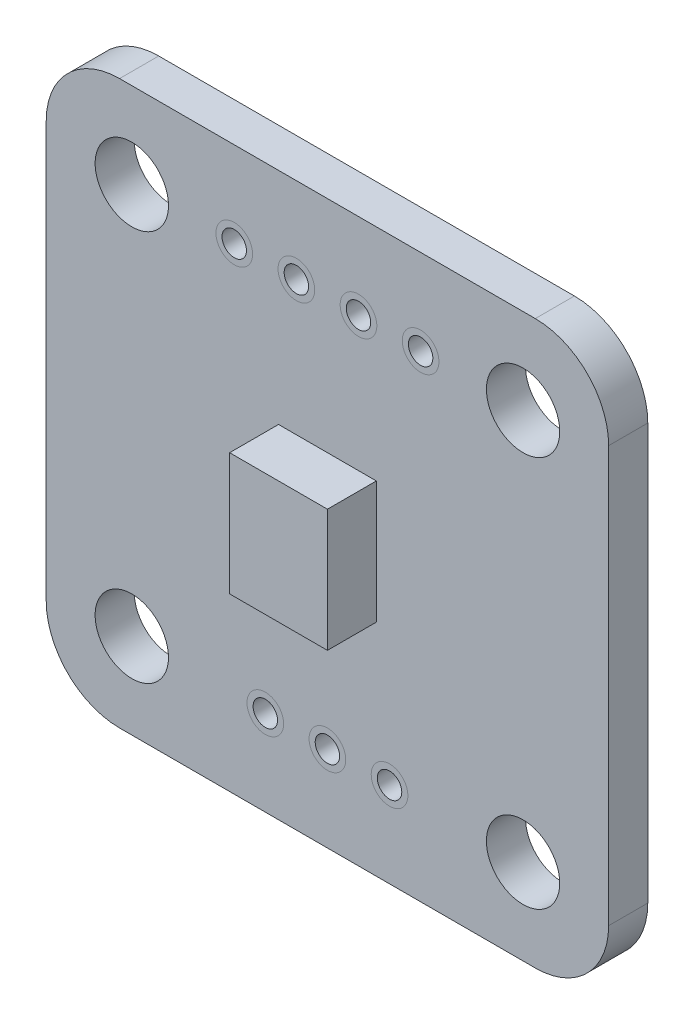
ISO-10303-21;
HEADER;
FILE_DESCRIPTION(('STEP AP214'),'2;1');
FILE_NAME('part.step','',(''),(''),'','','');
FILE_SCHEMA(('AUTOMOTIVE_DESIGN { 1 0 10303 214 1 1 1 1 }'));
ENDSEC;
DATA;
#1=APPLICATION_CONTEXT('core data for automotive mechanical design processes');
#2=APPLICATION_PROTOCOL_DEFINITION('international standard','automotive_design',2000,#1);
#3=PRODUCT_CONTEXT('',#1,'mechanical');
#4=PRODUCT('Part','Part','',(#3));
#5=PRODUCT_RELATED_PRODUCT_CATEGORY('part','',(#4));
#6=PRODUCT_DEFINITION_FORMATION('','',#4);
#7=PRODUCT_DEFINITION_CONTEXT('part definition',#1,'design');
#8=PRODUCT_DEFINITION('design','',#6,#7);
#9=PRODUCT_DEFINITION_SHAPE('','',#8);
#10=(LENGTH_UNIT() NAMED_UNIT(*) SI_UNIT(.MILLI.,.METRE.));
#11=(NAMED_UNIT(*) PLANE_ANGLE_UNIT() SI_UNIT($,.RADIAN.));
#12=(NAMED_UNIT(*) SI_UNIT($,.STERADIAN.) SOLID_ANGLE_UNIT());
#13=UNCERTAINTY_MEASURE_WITH_UNIT(LENGTH_MEASURE(1.E-05),#10,'distance_accuracy_value','');
#14=(GEOMETRIC_REPRESENTATION_CONTEXT(3) GLOBAL_UNCERTAINTY_ASSIGNED_CONTEXT((#13)) GLOBAL_UNIT_ASSIGNED_CONTEXT((#10,
#11,#12)) REPRESENTATION_CONTEXT('',''));
#15=CARTESIAN_POINT('',(0.,0.,0.));
#16=DIRECTION('',(0.,0.,1.));
#17=DIRECTION('',(1.,0.,0.));
#18=AXIS2_PLACEMENT_3D('',#15,#16,#17);
#19=CARTESIAN_POINT('',(-8.50000000000001,-8.5,-0.8));
#20=DIRECTION('',(0.,0.,-1.));
#21=DIRECTION('',(-1.,0.,0.));
#22=AXIS2_PLACEMENT_3D('',#19,#20,#21);
#23=PLANE('',#22);
#24=CARTESIAN_POINT('',(0.,-7.99999999999999,-0.8));
#25=DIRECTION('',(0.,0.,-1.));
#26=DIRECTION('',(-1.,0.,0.));
#27=AXIS2_PLACEMENT_3D('',#24,#25,#26);
#28=CIRCLE('',#27,0.75);
#29=CARTESIAN_POINT('',(-0.75,-7.99999999999999,-0.8));
#30=VERTEX_POINT('',#29);
#31=EDGE_CURVE('E323',#30,#30,#28,.F.);
#32=ORIENTED_EDGE('',*,*,#31,.T.);
#33=EDGE_LOOP('',(#32));
#34=FACE_BOUND('',#33,.T.);
#35=CARTESIAN_POINT('',(3.81,7.99999999999999,-0.8));
#36=DIRECTION('',(0.,0.,-1.));
#37=DIRECTION('',(-1.,0.,0.));
#38=AXIS2_PLACEMENT_3D('',#35,#36,#37);
#39=CIRCLE('',#38,0.75);
#40=CARTESIAN_POINT('',(3.06,7.99999999999999,-0.8));
#41=VERTEX_POINT('',#40);
#42=EDGE_CURVE('E307',#41,#41,#39,.F.);
#43=ORIENTED_EDGE('',*,*,#42,.T.);
#44=EDGE_LOOP('',(#43));
#45=FACE_BOUND('',#44,.T.);
#46=CARTESIAN_POINT('',(-1.27,7.99999999999999,-0.8));
#47=DIRECTION('',(0.,0.,-1.));
#48=DIRECTION('',(-1.,0.,0.));
#49=AXIS2_PLACEMENT_3D('',#46,#47,#48);
#50=CIRCLE('',#49,0.75);
#51=CARTESIAN_POINT('',(-2.02,7.99999999999999,-0.8));
#52=VERTEX_POINT('',#51);
#53=EDGE_CURVE('E291',#52,#52,#50,.F.);
#54=ORIENTED_EDGE('',*,*,#53,.T.);
#55=EDGE_LOOP('',(#54));
#56=FACE_BOUND('',#55,.T.);
#57=CARTESIAN_POINT('',(8.,-7.99999999999999,-0.8));
#58=DIRECTION('',(0.,0.,1.));
#59=DIRECTION('',(1.,0.,0.));
#60=AXIS2_PLACEMENT_3D('',#57,#58,#59);
#61=CIRCLE('',#60,1.5);
#62=CARTESIAN_POINT('',(9.5,-7.99999999999999,-0.8));
#63=VERTEX_POINT('',#62);
#64=EDGE_CURVE('E204',#63,#63,#61,.T.);
#65=ORIENTED_EDGE('',*,*,#64,.T.);
#66=EDGE_LOOP('',(#65));
#67=FACE_BOUND('',#66,.T.);
#68=CARTESIAN_POINT('',(-8.,7.99999999999999,-0.8));
#69=DIRECTION('',(0.,0.,1.));
#70=DIRECTION('',(1.,0.,0.));
#71=AXIS2_PLACEMENT_3D('',#68,#69,#70);
#72=CIRCLE('',#71,1.5);
#73=CARTESIAN_POINT('',(-6.5,7.99999999999999,-0.8));
#74=VERTEX_POINT('',#73);
#75=EDGE_CURVE('E216',#74,#74,#72,.T.);
#76=ORIENTED_EDGE('',*,*,#75,.T.);
#77=EDGE_LOOP('',(#76));
#78=FACE_BOUND('',#77,.T.);
#79=CARTESIAN_POINT('',(-8.50000000000001,-8.5,-0.8));
#80=DIRECTION('',(0.,0.,1.));
#81=DIRECTION('',(-1.,0.,0.));
#82=AXIS2_PLACEMENT_3D('',#79,#80,#81);
#83=CIRCLE('',#82,3.);
#84=CARTESIAN_POINT('',(-11.5,-8.49999999999998,-0.8));
#85=VERTEX_POINT('',#84);
#86=CARTESIAN_POINT('',(-8.49999999999998,-11.5,-0.8));
#87=VERTEX_POINT('',#86);
#88=EDGE_CURVE('E222',#85,#87,#83,.T.);
#89=ORIENTED_EDGE('',*,*,#88,.F.);
#90=DIRECTION('',(0.,-1.,0.));
#91=VECTOR('',#90,1.);
#92=CARTESIAN_POINT('',(-11.5,-8.49999999999998,-0.8));
#93=LINE('',#92,#91);
#94=CARTESIAN_POINT('',(-11.5,8.49999999999998,-0.8));
#95=VERTEX_POINT('',#94);
#96=EDGE_CURVE('E229',#95,#85,#93,.T.);
#97=ORIENTED_EDGE('',*,*,#96,.F.);
#98=CARTESIAN_POINT('',(-8.50000000000001,8.5,-0.8));
#99=DIRECTION('',(0.,0.,1.));
#100=DIRECTION('',(-1.,0.,0.));
#101=AXIS2_PLACEMENT_3D('',#98,#99,#100);
#102=CIRCLE('',#101,3.);
#103=CARTESIAN_POINT('',(-8.49999999999998,11.5,-0.8));
#104=VERTEX_POINT('',#103);
#105=EDGE_CURVE('E256',#104,#95,#102,.T.);
#106=ORIENTED_EDGE('',*,*,#105,.F.);
#107=DIRECTION('',(-1.,0.,0.));
#108=VECTOR('',#107,1.);
#109=CARTESIAN_POINT('',(-8.49999999999998,11.5,-0.8));
#110=LINE('',#109,#108);
#111=CARTESIAN_POINT('',(8.49999999999997,11.5,-0.8));
#112=VERTEX_POINT('',#111);
#113=EDGE_CURVE('E254',#112,#104,#110,.T.);
#114=ORIENTED_EDGE('',*,*,#113,.F.);
#115=CARTESIAN_POINT('',(8.49999999999999,8.5,-0.8));
#116=DIRECTION('',(0.,0.,1.));
#117=DIRECTION('',(-1.,0.,0.));
#118=AXIS2_PLACEMENT_3D('',#115,#116,#117);
#119=CIRCLE('',#118,3.);
#120=CARTESIAN_POINT('',(11.5,8.49999999999998,-0.8));
#121=VERTEX_POINT('',#120);
#122=EDGE_CURVE('E252',#121,#112,#119,.T.);
#123=ORIENTED_EDGE('',*,*,#122,.F.);
#124=DIRECTION('',(0.,1.,0.));
#125=VECTOR('',#124,1.);
#126=CARTESIAN_POINT('',(11.5,-8.49999999999998,-0.8));
#127=LINE('',#126,#125);
#128=CARTESIAN_POINT('',(11.5,-8.5,-0.8));
#129=VERTEX_POINT('',#128);
#130=EDGE_CURVE('E250',#129,#121,#127,.T.);
#131=ORIENTED_EDGE('',*,*,#130,.F.);
#132=CARTESIAN_POINT('',(8.49999999999999,-8.5,-0.8));
#133=DIRECTION('',(0.,0.,1.));
#134=DIRECTION('',(1.,0.,0.));
#135=AXIS2_PLACEMENT_3D('',#132,#133,#134);
#136=CIRCLE('',#135,3.);
#137=CARTESIAN_POINT('',(8.49999999999997,-11.5,-0.8));
#138=VERTEX_POINT('',#137);
#139=EDGE_CURVE('E248',#138,#129,#136,.T.);
#140=ORIENTED_EDGE('',*,*,#139,.F.);
#141=DIRECTION('',(1.,0.,0.));
#142=VECTOR('',#141,1.);
#143=CARTESIAN_POINT('',(-8.49999999999998,-11.5,-0.8));
#144=LINE('',#143,#142);
#145=EDGE_CURVE('E246',#87,#138,#144,.T.);
#146=ORIENTED_EDGE('',*,*,#145,.F.);
#147=EDGE_LOOP('',(#89,#97,#106,#114,#123,#131,#140,#146));
#148=FACE_BOUND('',#147,.T.);
#149=CARTESIAN_POINT('',(8.,7.99999999999999,-0.8));
#150=DIRECTION('',(0.,0.,1.));
#151=DIRECTION('',(1.,0.,0.));
#152=AXIS2_PLACEMENT_3D('',#149,#150,#151);
#153=CIRCLE('',#152,1.5);
#154=CARTESIAN_POINT('',(9.5,7.99999999999999,-0.8));
#155=VERTEX_POINT('',#154);
#156=EDGE_CURVE('E210',#155,#155,#153,.T.);
#157=ORIENTED_EDGE('',*,*,#156,.T.);
#158=EDGE_LOOP('',(#157));
#159=FACE_BOUND('',#158,.T.);
#160=CARTESIAN_POINT('',(-8.,-7.99999999999999,-0.8));
#161=DIRECTION('',(0.,0.,1.));
#162=DIRECTION('',(1.,0.,0.));
#163=AXIS2_PLACEMENT_3D('',#160,#161,#162);
#164=CIRCLE('',#163,1.5);
#165=CARTESIAN_POINT('',(-6.5,-7.99999999999999,-0.8));
#166=VERTEX_POINT('',#165);
#167=EDGE_CURVE('E198',#166,#166,#164,.T.);
#168=ORIENTED_EDGE('',*,*,#167,.T.);
#169=EDGE_LOOP('',(#168));
#170=FACE_BOUND('',#169,.T.);
#171=CARTESIAN_POINT('',(-3.81,7.99999999999999,-0.8));
#172=DIRECTION('',(0.,0.,-1.));
#173=DIRECTION('',(-1.,0.,0.));
#174=AXIS2_PLACEMENT_3D('',#171,#172,#173);
#175=CIRCLE('',#174,0.75);
#176=CARTESIAN_POINT('',(-4.56,7.99999999999999,-0.8));
#177=VERTEX_POINT('',#176);
#178=EDGE_CURVE('E283',#177,#177,#175,.F.);
#179=ORIENTED_EDGE('',*,*,#178,.T.);
#180=EDGE_LOOP('',(#179));
#181=FACE_BOUND('',#180,.T.);
#182=CARTESIAN_POINT('',(1.27,7.99999999999999,-0.8));
#183=DIRECTION('',(0.,0.,-1.));
#184=DIRECTION('',(-1.,0.,0.));
#185=AXIS2_PLACEMENT_3D('',#182,#183,#184);
#186=CIRCLE('',#185,0.75);
#187=CARTESIAN_POINT('',(0.519999999999999,7.99999999999999,-0.8));
#188=VERTEX_POINT('',#187);
#189=EDGE_CURVE('E299',#188,#188,#186,.F.);
#190=ORIENTED_EDGE('',*,*,#189,.T.);
#191=EDGE_LOOP('',(#190));
#192=FACE_BOUND('',#191,.T.);
#193=CARTESIAN_POINT('',(-2.54,-7.99999999999999,-0.8));
#194=DIRECTION('',(0.,0.,-1.));
#195=DIRECTION('',(-1.,0.,0.));
#196=AXIS2_PLACEMENT_3D('',#193,#194,#195);
#197=CIRCLE('',#196,0.75);
#198=CARTESIAN_POINT('',(-3.29,-7.99999999999999,-0.8));
#199=VERTEX_POINT('',#198);
#200=EDGE_CURVE('E315',#199,#199,#197,.F.);
#201=ORIENTED_EDGE('',*,*,#200,.T.);
#202=EDGE_LOOP('',(#201));
#203=FACE_BOUND('',#202,.T.);
#204=CARTESIAN_POINT('',(2.54,-7.99999999999999,-0.8));
#205=DIRECTION('',(0.,0.,-1.));
#206=DIRECTION('',(-1.,0.,0.));
#207=AXIS2_PLACEMENT_3D('',#204,#205,#206);
#208=CIRCLE('',#207,0.75);
#209=CARTESIAN_POINT('',(1.79,-7.99999999999999,-0.8));
#210=VERTEX_POINT('',#209);
#211=EDGE_CURVE('E11',#210,#210,#208,.F.);
#212=ORIENTED_EDGE('',*,*,#211,.T.);
#213=EDGE_LOOP('',(#212));
#214=FACE_BOUND('',#213,.T.);
#215=ADVANCED_FACE('F42',(#34,#45,#56,#67,#78,#148,#159,#170,#181,#192,#203,#214),#23,.T.);
#216=CARTESIAN_POINT('',(-8.50000000000001,-8.5,0.8));
#217=DIRECTION('',(0.,0.,-1.));
#218=DIRECTION('',(-1.,0.,0.));
#219=AXIS2_PLACEMENT_3D('',#216,#217,#218);
#220=PLANE('',#219);
#221=CARTESIAN_POINT('',(0.,-7.99999999999999,0.8));
#222=DIRECTION('',(0.,0.,-1.));
#223=DIRECTION('',(-1.,0.,0.));
#224=AXIS2_PLACEMENT_3D('',#221,#222,#223);
#225=CIRCLE('',#224,0.75);
#226=CARTESIAN_POINT('',(-0.75,-7.99999999999999,0.8));
#227=VERTEX_POINT('',#226);
#228=EDGE_CURVE('E319',#227,#227,#225,.F.);
#229=ORIENTED_EDGE('',*,*,#228,.F.);
#230=EDGE_LOOP('',(#229));
#231=FACE_BOUND('',#230,.T.);
#232=CARTESIAN_POINT('',(3.81,7.99999999999999,0.8));
#233=DIRECTION('',(0.,0.,-1.));
#234=DIRECTION('',(-1.,0.,0.));
#235=AXIS2_PLACEMENT_3D('',#232,#233,#234);
#236=CIRCLE('',#235,0.75);
#237=CARTESIAN_POINT('',(3.06,7.99999999999999,0.8));
#238=VERTEX_POINT('',#237);
#239=EDGE_CURVE('E303',#238,#238,#236,.F.);
#240=ORIENTED_EDGE('',*,*,#239,.F.);
#241=EDGE_LOOP('',(#240));
#242=FACE_BOUND('',#241,.T.);
#243=CARTESIAN_POINT('',(-1.27,7.99999999999999,0.8));
#244=DIRECTION('',(0.,0.,-1.));
#245=DIRECTION('',(-1.,0.,0.));
#246=AXIS2_PLACEMENT_3D('',#243,#244,#245);
#247=CIRCLE('',#246,0.75);
#248=CARTESIAN_POINT('',(-2.02,7.99999999999999,0.8));
#249=VERTEX_POINT('',#248);
#250=EDGE_CURVE('E287',#249,#249,#247,.F.);
#251=ORIENTED_EDGE('',*,*,#250,.F.);
#252=EDGE_LOOP('',(#251));
#253=FACE_BOUND('',#252,.T.);
#254=DIRECTION('',(0.,1.,0.));
#255=VECTOR('',#254,1.);
#256=CARTESIAN_POINT('',(2.,2.5,0.8));
#257=LINE('',#256,#255);
#258=CARTESIAN_POINT('',(2.,-2.5,0.8));
#259=VERTEX_POINT('',#258);
#260=CARTESIAN_POINT('',(2.,2.5,0.8));
#261=VERTEX_POINT('',#260);
#262=EDGE_CURVE('E152',#259,#261,#257,.T.);
#263=ORIENTED_EDGE('',*,*,#262,.F.);
#264=DIRECTION('',(1.,0.,0.));
#265=VECTOR('',#264,1.);
#266=CARTESIAN_POINT('',(-2.,-2.5,0.8));
#267=LINE('',#266,#265);
#268=CARTESIAN_POINT('',(-2.,-2.5,0.8));
#269=VERTEX_POINT('',#268);
#270=EDGE_CURVE('E149',#269,#259,#267,.T.);
#271=ORIENTED_EDGE('',*,*,#270,.F.);
#272=DIRECTION('',(0.,-1.,0.));
#273=VECTOR('',#272,1.);
#274=CARTESIAN_POINT('',(-2.,2.5,0.8));
#275=LINE('',#274,#273);
#276=CARTESIAN_POINT('',(-2.,2.5,0.8));
#277=VERTEX_POINT('',#276);
#278=EDGE_CURVE('E63',#277,#269,#275,.T.);
#279=ORIENTED_EDGE('',*,*,#278,.F.);
#280=DIRECTION('',(-1.,0.,0.));
#281=VECTOR('',#280,1.);
#282=CARTESIAN_POINT('',(-2.,2.5,0.8));
#283=LINE('',#282,#281);
#284=EDGE_CURVE('E58',#261,#277,#283,.T.);
#285=ORIENTED_EDGE('',*,*,#284,.F.);
#286=EDGE_LOOP('',(#263,#271,#279,#285));
#287=FACE_BOUND('',#286,.T.);
#288=CARTESIAN_POINT('',(-8.50000000000001,-8.5,0.8));
#289=DIRECTION('',(0.,0.,1.));
#290=DIRECTION('',(-1.,0.,0.));
#291=AXIS2_PLACEMENT_3D('',#288,#289,#290);
#292=CIRCLE('',#291,3.);
#293=CARTESIAN_POINT('',(-11.5,-8.49999999999998,0.8));
#294=VERTEX_POINT('',#293);
#295=CARTESIAN_POINT('',(-8.49999999999998,-11.5,0.8));
#296=VERTEX_POINT('',#295);
#297=EDGE_CURVE('E225',#294,#296,#292,.T.);
#298=ORIENTED_EDGE('',*,*,#297,.T.);
#299=DIRECTION('',(1.,0.,0.));
#300=VECTOR('',#299,1.);
#301=CARTESIAN_POINT('',(-8.49999999999998,-11.5,0.8));
#302=LINE('',#301,#300);
#303=CARTESIAN_POINT('',(8.49999999999997,-11.5,0.8));
#304=VERTEX_POINT('',#303);
#305=EDGE_CURVE('E228',#296,#304,#302,.T.);
#306=ORIENTED_EDGE('',*,*,#305,.T.);
#307=CARTESIAN_POINT('',(8.49999999999999,-8.5,0.8));
#308=DIRECTION('',(0.,0.,1.));
#309=DIRECTION('',(1.,0.,0.));
#310=AXIS2_PLACEMENT_3D('',#307,#308,#309);
#311=CIRCLE('',#310,3.);
#312=CARTESIAN_POINT('',(11.5,-8.5,0.8));
#313=VERTEX_POINT('',#312);
#314=EDGE_CURVE('E231',#304,#313,#311,.T.);
#315=ORIENTED_EDGE('',*,*,#314,.T.);
#316=DIRECTION('',(0.,1.,0.));
#317=VECTOR('',#316,1.);
#318=CARTESIAN_POINT('',(11.5,-8.49999999999998,0.8));
#319=LINE('',#318,#317);
#320=CARTESIAN_POINT('',(11.5,8.49999999999998,0.8));
#321=VERTEX_POINT('',#320);
#322=EDGE_CURVE('E233',#313,#321,#319,.T.);
#323=ORIENTED_EDGE('',*,*,#322,.T.);
#324=CARTESIAN_POINT('',(8.49999999999999,8.5,0.8));
#325=DIRECTION('',(0.,0.,1.));
#326=DIRECTION('',(-1.,0.,0.));
#327=AXIS2_PLACEMENT_3D('',#324,#325,#326);
#328=CIRCLE('',#327,3.);
#329=CARTESIAN_POINT('',(8.49999999999997,11.5,0.8));
#330=VERTEX_POINT('',#329);
#331=EDGE_CURVE('E235',#321,#330,#328,.T.);
#332=ORIENTED_EDGE('',*,*,#331,.T.);
#333=DIRECTION('',(-1.,0.,0.));
#334=VECTOR('',#333,1.);
#335=CARTESIAN_POINT('',(-8.49999999999998,11.5,0.8));
#336=LINE('',#335,#334);
#337=CARTESIAN_POINT('',(-8.49999999999998,11.5,0.8));
#338=VERTEX_POINT('',#337);
#339=EDGE_CURVE('E237',#330,#338,#336,.T.);
#340=ORIENTED_EDGE('',*,*,#339,.T.);
#341=CARTESIAN_POINT('',(-8.50000000000001,8.5,0.8));
#342=DIRECTION('',(0.,0.,1.));
#343=DIRECTION('',(-1.,0.,0.));
#344=AXIS2_PLACEMENT_3D('',#341,#342,#343);
#345=CIRCLE('',#344,3.);
#346=CARTESIAN_POINT('',(-11.5,8.49999999999998,0.8));
#347=VERTEX_POINT('',#346);
#348=EDGE_CURVE('E239',#338,#347,#345,.T.);
#349=ORIENTED_EDGE('',*,*,#348,.T.);
#350=DIRECTION('',(0.,-1.,0.));
#351=VECTOR('',#350,1.);
#352=CARTESIAN_POINT('',(-11.5,-8.49999999999998,0.8));
#353=LINE('',#352,#351);
#354=EDGE_CURVE('E241',#347,#294,#353,.T.);
#355=ORIENTED_EDGE('',*,*,#354,.T.);
#356=EDGE_LOOP('',(#298,#306,#315,#323,#332,#340,#349,#355));
#357=FACE_BOUND('',#356,.T.);
#358=CARTESIAN_POINT('',(-8.,7.99999999999999,0.8));
#359=DIRECTION('',(0.,0.,1.));
#360=DIRECTION('',(1.,0.,0.));
#361=AXIS2_PLACEMENT_3D('',#358,#359,#360);
#362=CIRCLE('',#361,1.5);
#363=CARTESIAN_POINT('',(-6.5,7.99999999999999,0.8));
#364=VERTEX_POINT('',#363);
#365=EDGE_CURVE('E219',#364,#364,#362,.T.);
#366=ORIENTED_EDGE('',*,*,#365,.F.);
#367=EDGE_LOOP('',(#366));
#368=FACE_BOUND('',#367,.T.);
#369=CARTESIAN_POINT('',(8.,7.99999999999999,0.8));
#370=DIRECTION('',(0.,0.,1.));
#371=DIRECTION('',(1.,0.,0.));
#372=AXIS2_PLACEMENT_3D('',#369,#370,#371);
#373=CIRCLE('',#372,1.5);
#374=CARTESIAN_POINT('',(9.5,7.99999999999999,0.8));
#375=VERTEX_POINT('',#374);
#376=EDGE_CURVE('E213',#375,#375,#373,.T.);
#377=ORIENTED_EDGE('',*,*,#376,.F.);
#378=EDGE_LOOP('',(#377));
#379=FACE_BOUND('',#378,.T.);
#380=CARTESIAN_POINT('',(8.,-7.99999999999999,0.8));
#381=DIRECTION('',(0.,0.,1.));
#382=DIRECTION('',(1.,0.,0.));
#383=AXIS2_PLACEMENT_3D('',#380,#381,#382);
#384=CIRCLE('',#383,1.5);
#385=CARTESIAN_POINT('',(9.5,-7.99999999999999,0.8));
#386=VERTEX_POINT('',#385);
#387=EDGE_CURVE('E207',#386,#386,#384,.T.);
#388=ORIENTED_EDGE('',*,*,#387,.F.);
#389=EDGE_LOOP('',(#388));
#390=FACE_BOUND('',#389,.T.);
#391=CARTESIAN_POINT('',(-8.,-7.99999999999999,0.8));
#392=DIRECTION('',(0.,0.,1.));
#393=DIRECTION('',(1.,0.,0.));
#394=AXIS2_PLACEMENT_3D('',#391,#392,#393);
#395=CIRCLE('',#394,1.5);
#396=CARTESIAN_POINT('',(-6.5,-7.99999999999999,0.8));
#397=VERTEX_POINT('',#396);
#398=EDGE_CURVE('E201',#397,#397,#395,.T.);
#399=ORIENTED_EDGE('',*,*,#398,.F.);
#400=EDGE_LOOP('',(#399));
#401=FACE_BOUND('',#400,.T.);
#402=CARTESIAN_POINT('',(-3.81,7.99999999999999,0.8));
#403=DIRECTION('',(0.,0.,-1.));
#404=DIRECTION('',(-1.,0.,0.));
#405=AXIS2_PLACEMENT_3D('',#402,#403,#404);
#406=CIRCLE('',#405,0.75);
#407=CARTESIAN_POINT('',(-4.56,7.99999999999999,0.8));
#408=VERTEX_POINT('',#407);
#409=EDGE_CURVE('E282',#408,#408,#406,.F.);
#410=ORIENTED_EDGE('',*,*,#409,.F.);
#411=EDGE_LOOP('',(#410));
#412=FACE_BOUND('',#411,.T.);
#413=CARTESIAN_POINT('',(1.27,7.99999999999999,0.8));
#414=DIRECTION('',(0.,0.,-1.));
#415=DIRECTION('',(-1.,0.,0.));
#416=AXIS2_PLACEMENT_3D('',#413,#414,#415);
#417=CIRCLE('',#416,0.75);
#418=CARTESIAN_POINT('',(0.519999999999999,7.99999999999999,0.8));
#419=VERTEX_POINT('',#418);
#420=EDGE_CURVE('E295',#419,#419,#417,.F.);
#421=ORIENTED_EDGE('',*,*,#420,.F.);
#422=EDGE_LOOP('',(#421));
#423=FACE_BOUND('',#422,.T.);
#424=CARTESIAN_POINT('',(-2.54,-7.99999999999999,0.8));
#425=DIRECTION('',(0.,0.,-1.));
#426=DIRECTION('',(-1.,0.,0.));
#427=AXIS2_PLACEMENT_3D('',#424,#425,#426);
#428=CIRCLE('',#427,0.75);
#429=CARTESIAN_POINT('',(-3.29,-7.99999999999999,0.8));
#430=VERTEX_POINT('',#429);
#431=EDGE_CURVE('E311',#430,#430,#428,.F.);
#432=ORIENTED_EDGE('',*,*,#431,.F.);
#433=EDGE_LOOP('',(#432));
#434=FACE_BOUND('',#433,.T.);
#435=CARTESIAN_POINT('',(2.54,-7.99999999999999,0.8));
#436=DIRECTION('',(0.,0.,-1.));
#437=DIRECTION('',(-1.,0.,0.));
#438=AXIS2_PLACEMENT_3D('',#435,#436,#437);
#439=CIRCLE('',#438,0.75);
#440=CARTESIAN_POINT('',(1.79,-7.99999999999999,0.8));
#441=VERTEX_POINT('',#440);
#442=EDGE_CURVE('E46',#441,#441,#439,.F.);
#443=ORIENTED_EDGE('',*,*,#442,.F.);
#444=EDGE_LOOP('',(#443));
#445=FACE_BOUND('',#444,.T.);
#446=ADVANCED_FACE('F336',(#231,#242,#253,#287,#357,#368,#379,#390,#401,#412,#423,#434,#445),
#220,.F.);
#447=ORIENTED_EDGE('',*,*,#211,.F.);
#448=EDGE_LOOP('',(#447));
#449=FACE_BOUND('',#448,.T.);
#450=CARTESIAN_POINT('',(2.54,-7.99999999999999,-0.8));
#451=DIRECTION('',(0.,0.,1.));
#452=DIRECTION('',(1.,0.,0.));
#453=AXIS2_PLACEMENT_3D('',#450,#451,#452);
#454=CIRCLE('',#453,0.5);
#455=CARTESIAN_POINT('',(3.04,-7.99999999999999,-0.8));
#456=VERTEX_POINT('',#455);
#457=EDGE_CURVE('E180',#456,#456,#454,.T.);
#458=ORIENTED_EDGE('',*,*,#457,.T.);
#459=EDGE_LOOP('',(#458));
#460=FACE_BOUND('',#459,.T.);
#461=ADVANCED_FACE('F339',(#449,#460),#23,.T.);
#462=ORIENTED_EDGE('',*,*,#442,.T.);
#463=EDGE_LOOP('',(#462));
#464=FACE_BOUND('',#463,.T.);
#465=CARTESIAN_POINT('',(2.54,-7.99999999999999,0.8));
#466=DIRECTION('',(0.,0.,1.));
#467=DIRECTION('',(1.,0.,0.));
#468=AXIS2_PLACEMENT_3D('',#465,#466,#467);
#469=CIRCLE('',#468,0.5);
#470=CARTESIAN_POINT('',(3.04,-7.99999999999999,0.8));
#471=VERTEX_POINT('',#470);
#472=EDGE_CURVE('E183',#471,#471,#469,.T.);
#473=ORIENTED_EDGE('',*,*,#472,.F.);
#474=EDGE_LOOP('',(#473));
#475=FACE_BOUND('',#474,.T.);
#476=ADVANCED_FACE('F341',(#464,#475),#220,.F.);
#477=ORIENTED_EDGE('',*,*,#31,.F.);
#478=EDGE_LOOP('',(#477));
#479=FACE_BOUND('',#478,.T.);
#480=CARTESIAN_POINT('',(0.,-7.99999999999999,-0.8));
#481=DIRECTION('',(0.,0.,1.));
#482=DIRECTION('',(1.,0.,0.));
#483=AXIS2_PLACEMENT_3D('',#480,#481,#482);
#484=CIRCLE('',#483,0.5);
#485=CARTESIAN_POINT('',(0.5,-7.99999999999999,-0.8));
#486=VERTEX_POINT('',#485);
#487=EDGE_CURVE('E192',#486,#486,#484,.T.);
#488=ORIENTED_EDGE('',*,*,#487,.T.);
#489=EDGE_LOOP('',(#488));
#490=FACE_BOUND('',#489,.T.);
#491=ADVANCED_FACE('F377',(#479,#490),#23,.T.);
#492=ORIENTED_EDGE('',*,*,#228,.T.);
#493=EDGE_LOOP('',(#492));
#494=FACE_BOUND('',#493,.T.);
#495=CARTESIAN_POINT('',(0.,-7.99999999999999,0.8));
#496=DIRECTION('',(0.,0.,1.));
#497=DIRECTION('',(1.,0.,0.));
#498=AXIS2_PLACEMENT_3D('',#495,#496,#497);
#499=CIRCLE('',#498,0.5);
#500=CARTESIAN_POINT('',(0.5,-7.99999999999999,0.8));
#501=VERTEX_POINT('',#500);
#502=EDGE_CURVE('E195',#501,#501,#499,.T.);
#503=ORIENTED_EDGE('',*,*,#502,.F.);
#504=EDGE_LOOP('',(#503));
#505=FACE_BOUND('',#504,.T.);
#506=ADVANCED_FACE('F333',(#494,#505),#220,.F.);
#507=ORIENTED_EDGE('',*,*,#200,.F.);
#508=EDGE_LOOP('',(#507));
#509=FACE_BOUND('',#508,.T.);
#510=CARTESIAN_POINT('',(-2.54,-7.99999999999999,-0.8));
#511=DIRECTION('',(0.,0.,1.));
#512=DIRECTION('',(1.,0.,0.));
#513=AXIS2_PLACEMENT_3D('',#510,#511,#512);
#514=CIRCLE('',#513,0.5);
#515=CARTESIAN_POINT('',(-2.04,-7.99999999999999,-0.8));
#516=VERTEX_POINT('',#515);
#517=EDGE_CURVE('E186',#516,#516,#514,.T.);
#518=ORIENTED_EDGE('',*,*,#517,.T.);
#519=EDGE_LOOP('',(#518));
#520=FACE_BOUND('',#519,.T.);
#521=ADVANCED_FACE('F398',(#509,#520),#23,.T.);
#522=ORIENTED_EDGE('',*,*,#431,.T.);
#523=EDGE_LOOP('',(#522));
#524=FACE_BOUND('',#523,.T.);
#525=CARTESIAN_POINT('',(-2.54,-7.99999999999999,0.8));
#526=DIRECTION('',(0.,0.,1.));
#527=DIRECTION('',(1.,0.,0.));
#528=AXIS2_PLACEMENT_3D('',#525,#526,#527);
#529=CIRCLE('',#528,0.5);
#530=CARTESIAN_POINT('',(-2.04,-7.99999999999999,0.8));
#531=VERTEX_POINT('',#530);
#532=EDGE_CURVE('E189',#531,#531,#529,.T.);
#533=ORIENTED_EDGE('',*,*,#532,.F.);
#534=EDGE_LOOP('',(#533));
#535=FACE_BOUND('',#534,.T.);
#536=ADVANCED_FACE('F437',(#524,#535),#220,.F.);
#537=ORIENTED_EDGE('',*,*,#42,.F.);
#538=EDGE_LOOP('',(#537));
#539=FACE_BOUND('',#538,.T.);
#540=CARTESIAN_POINT('',(3.81,7.99999999999999,-0.8));
#541=DIRECTION('',(0.,0.,1.));
#542=DIRECTION('',(1.,0.,0.));
#543=AXIS2_PLACEMENT_3D('',#540,#541,#542);
#544=CIRCLE('',#543,0.500000000000001);
#545=CARTESIAN_POINT('',(4.31,7.99999999999999,-0.8));
#546=VERTEX_POINT('',#545);
#547=EDGE_CURVE('E153',#546,#546,#544,.T.);
#548=ORIENTED_EDGE('',*,*,#547,.T.);
#549=EDGE_LOOP('',(#548));
#550=FACE_BOUND('',#549,.T.);
#551=ADVANCED_FACE('F432',(#539,#550),#23,.T.);
#552=ORIENTED_EDGE('',*,*,#239,.T.);
#553=EDGE_LOOP('',(#552));
#554=FACE_BOUND('',#553,.T.);
#555=CARTESIAN_POINT('',(3.81,7.99999999999999,0.8));
#556=DIRECTION('',(0.,0.,1.));
#557=DIRECTION('',(1.,0.,0.));
#558=AXIS2_PLACEMENT_3D('',#555,#556,#557);
#559=CIRCLE('',#558,0.500000000000001);
#560=CARTESIAN_POINT('',(4.31,7.99999999999999,0.8));
#561=VERTEX_POINT('',#560);
#562=EDGE_CURVE('E156',#561,#561,#559,.T.);
#563=ORIENTED_EDGE('',*,*,#562,.F.);
#564=EDGE_LOOP('',(#563));
#565=FACE_BOUND('',#564,.T.);
#566=ADVANCED_FACE('F427',(#554,#565),#220,.F.);
#567=ORIENTED_EDGE('',*,*,#189,.F.);
#568=EDGE_LOOP('',(#567));
#569=FACE_BOUND('',#568,.T.);
#570=CARTESIAN_POINT('',(1.27,7.99999999999999,-0.8));
#571=DIRECTION('',(0.,0.,1.));
#572=DIRECTION('',(1.,0.,0.));
#573=AXIS2_PLACEMENT_3D('',#570,#571,#572);
#574=CIRCLE('',#573,0.5);
#575=CARTESIAN_POINT('',(1.77,7.99999999999999,-0.8));
#576=VERTEX_POINT('',#575);
#577=EDGE_CURVE('E168',#576,#576,#574,.T.);
#578=ORIENTED_EDGE('',*,*,#577,.T.);
#579=EDGE_LOOP('',(#578));
#580=FACE_BOUND('',#579,.T.);
#581=ADVANCED_FACE('F420',(#569,#580),#23,.T.);
#582=ORIENTED_EDGE('',*,*,#420,.T.);
#583=EDGE_LOOP('',(#582));
#584=FACE_BOUND('',#583,.T.);
#585=CARTESIAN_POINT('',(1.27,7.99999999999999,0.8));
#586=DIRECTION('',(0.,0.,1.));
#587=DIRECTION('',(1.,0.,0.));
#588=AXIS2_PLACEMENT_3D('',#585,#586,#587);
#589=CIRCLE('',#588,0.5);
#590=CARTESIAN_POINT('',(1.77,7.99999999999999,0.8));
#591=VERTEX_POINT('',#590);
#592=EDGE_CURVE('E171',#591,#591,#589,.T.);
#593=ORIENTED_EDGE('',*,*,#592,.F.);
#594=EDGE_LOOP('',(#593));
#595=FACE_BOUND('',#594,.T.);
#596=ADVANCED_FACE('F418',(#584,#595),#220,.F.);
#597=ORIENTED_EDGE('',*,*,#53,.F.);
#598=EDGE_LOOP('',(#597));
#599=FACE_BOUND('',#598,.T.);
#600=CARTESIAN_POINT('',(-1.27,7.99999999999999,-0.8));
#601=DIRECTION('',(0.,0.,1.));
#602=DIRECTION('',(1.,0.,0.));
#603=AXIS2_PLACEMENT_3D('',#600,#601,#602);
#604=CIRCLE('',#603,0.5);
#605=CARTESIAN_POINT('',(-0.770000000000001,7.99999999999999,-0.8));
#606=VERTEX_POINT('',#605);
#607=EDGE_CURVE('E174',#606,#606,#604,.T.);
#608=ORIENTED_EDGE('',*,*,#607,.T.);
#609=EDGE_LOOP('',(#608));
#610=FACE_BOUND('',#609,.T.);
#611=ADVANCED_FACE('F406',(#599,#610),#23,.T.);
#612=ORIENTED_EDGE('',*,*,#250,.T.);
#613=EDGE_LOOP('',(#612));
#614=FACE_BOUND('',#613,.T.);
#615=CARTESIAN_POINT('',(-1.27,7.99999999999999,0.8));
#616=DIRECTION('',(0.,0.,1.));
#617=DIRECTION('',(1.,0.,0.));
#618=AXIS2_PLACEMENT_3D('',#615,#616,#617);
#619=CIRCLE('',#618,0.5);
#620=CARTESIAN_POINT('',(-0.770000000000001,7.99999999999999,0.8));
#621=VERTEX_POINT('',#620);
#622=EDGE_CURVE('E177',#621,#621,#619,.T.);
#623=ORIENTED_EDGE('',*,*,#622,.F.);
#624=EDGE_LOOP('',(#623));
#625=FACE_BOUND('',#624,.T.);
#626=ADVANCED_FACE('F413',(#614,#625),#220,.F.);
#627=ORIENTED_EDGE('',*,*,#409,.T.);
#628=EDGE_LOOP('',(#627));
#629=FACE_BOUND('',#628,.T.);
#630=CARTESIAN_POINT('',(-3.81,7.99999999999999,0.8));
#631=DIRECTION('',(0.,0.,1.));
#632=DIRECTION('',(1.,0.,0.));
#633=AXIS2_PLACEMENT_3D('',#630,#631,#632);
#634=CIRCLE('',#633,0.5);
#635=CARTESIAN_POINT('',(-3.31,7.99999999999999,0.8));
#636=VERTEX_POINT('',#635);
#637=EDGE_CURVE('E165',#636,#636,#634,.T.);
#638=ORIENTED_EDGE('',*,*,#637,.F.);
#639=EDGE_LOOP('',(#638));
#640=FACE_BOUND('',#639,.T.);
#641=ADVANCED_FACE('F342',(#629,#640),#220,.F.);
#642=ORIENTED_EDGE('',*,*,#178,.F.);
#643=EDGE_LOOP('',(#642));
#644=FACE_BOUND('',#643,.T.);
#645=CARTESIAN_POINT('',(-3.81,7.99999999999999,-0.8));
#646=DIRECTION('',(0.,0.,1.));
#647=DIRECTION('',(1.,0.,0.));
#648=AXIS2_PLACEMENT_3D('',#645,#646,#647);
#649=CIRCLE('',#648,0.5);
#650=CARTESIAN_POINT('',(-3.31,7.99999999999999,-0.8));
#651=VERTEX_POINT('',#650);
#652=EDGE_CURVE('E163',#651,#651,#649,.T.);
#653=ORIENTED_EDGE('',*,*,#652,.T.);
#654=EDGE_LOOP('',(#653));
#655=FACE_BOUND('',#654,.T.);
#656=ADVANCED_FACE('F394',(#644,#655),#23,.T.);
#657=CARTESIAN_POINT('',(-8.50000000000001,-8.5,0.8));
#658=DIRECTION('',(0.,0.,-1.));
#659=DIRECTION('',(-1.,0.,0.));
#660=AXIS2_PLACEMENT_3D('',#657,#658,#659);
#661=CYLINDRICAL_SURFACE('',#660,3.);
#662=ORIENTED_EDGE('',*,*,#88,.T.);
#663=DIRECTION('',(0.,0.,-1.));
#664=VECTOR('',#663,1.);
#665=CARTESIAN_POINT('',(-8.49999999999998,-11.5,0.8));
#666=LINE('',#665,#664);
#667=EDGE_CURVE('E279',#296,#87,#666,.T.);
#668=ORIENTED_EDGE('',*,*,#667,.F.);
#669=ORIENTED_EDGE('',*,*,#297,.F.);
#670=DIRECTION('',(0.,0.,-1.));
#671=VECTOR('',#670,1.);
#672=CARTESIAN_POINT('',(-11.5,-8.49999999999998,0.8));
#673=LINE('',#672,#671);
#674=EDGE_CURVE('E243',#294,#85,#673,.T.);
#675=ORIENTED_EDGE('',*,*,#674,.T.);
#676=EDGE_LOOP('',(#662,#668,#669,#675));
#677=FACE_BOUND('',#676,.T.);
#678=ADVANCED_FACE('F44',(#677),#661,.T.);
#679=CARTESIAN_POINT('',(-8.49999999999998,-11.5,0.8));
#680=DIRECTION('',(0.,1.,0.));
#681=DIRECTION('',(0.,0.,1.));
#682=AXIS2_PLACEMENT_3D('',#679,#680,#681);
#683=PLANE('',#682);
#684=ORIENTED_EDGE('',*,*,#145,.T.);
#685=DIRECTION('',(0.,0.,-1.));
#686=VECTOR('',#685,1.);
#687=CARTESIAN_POINT('',(8.49999999999997,-11.5,0.8));
#688=LINE('',#687,#686);
#689=EDGE_CURVE('E276',#304,#138,#688,.T.);
#690=ORIENTED_EDGE('',*,*,#689,.F.);
#691=ORIENTED_EDGE('',*,*,#305,.F.);
#692=ORIENTED_EDGE('',*,*,#667,.T.);
#693=EDGE_LOOP('',(#684,#690,#691,#692));
#694=FACE_BOUND('',#693,.T.);
#695=ADVANCED_FACE('F411',(#694),#683,.F.);
#696=CARTESIAN_POINT('',(8.49999999999999,-8.5,0.8));
#697=DIRECTION('',(0.,0.,-1.));
#698=DIRECTION('',(-1.,0.,0.));
#699=AXIS2_PLACEMENT_3D('',#696,#697,#698);
#700=CYLINDRICAL_SURFACE('',#699,3.);
#701=ORIENTED_EDGE('',*,*,#139,.T.);
#702=DIRECTION('',(0.,0.,-1.));
#703=VECTOR('',#702,1.);
#704=CARTESIAN_POINT('',(11.5,-8.5,0.8));
#705=LINE('',#704,#703);
#706=EDGE_CURVE('E273',#313,#129,#705,.T.);
#707=ORIENTED_EDGE('',*,*,#706,.F.);
#708=ORIENTED_EDGE('',*,*,#314,.F.);
#709=ORIENTED_EDGE('',*,*,#689,.T.);
#710=EDGE_LOOP('',(#701,#707,#708,#709));
#711=FACE_BOUND('',#710,.T.);
#712=ADVANCED_FACE('F529',(#711),#700,.T.);
#713=CARTESIAN_POINT('',(11.5,-8.49999999999998,0.8));
#714=DIRECTION('',(-1.,0.,0.));
#715=DIRECTION('',(0.,0.,1.));
#716=AXIS2_PLACEMENT_3D('',#713,#714,#715);
#717=PLANE('',#716);
#718=ORIENTED_EDGE('',*,*,#130,.T.);
#719=DIRECTION('',(0.,0.,-1.));
#720=VECTOR('',#719,1.);
#721=CARTESIAN_POINT('',(11.5,8.49999999999998,0.8));
#722=LINE('',#721,#720);
#723=EDGE_CURVE('E270',#321,#121,#722,.T.);
#724=ORIENTED_EDGE('',*,*,#723,.F.);
#725=ORIENTED_EDGE('',*,*,#322,.F.);
#726=ORIENTED_EDGE('',*,*,#706,.T.);
#727=EDGE_LOOP('',(#718,#724,#725,#726));
#728=FACE_BOUND('',#727,.T.);
#729=ADVANCED_FACE('F526',(#728),#717,.F.);
#730=CARTESIAN_POINT('',(8.49999999999999,8.5,0.8));
#731=DIRECTION('',(0.,0.,-1.));
#732=DIRECTION('',(-1.,0.,0.));
#733=AXIS2_PLACEMENT_3D('',#730,#731,#732);
#734=CYLINDRICAL_SURFACE('',#733,3.);
#735=ORIENTED_EDGE('',*,*,#122,.T.);
#736=DIRECTION('',(0.,0.,-1.));
#737=VECTOR('',#736,1.);
#738=CARTESIAN_POINT('',(8.49999999999997,11.5,0.8));
#739=LINE('',#738,#737);
#740=EDGE_CURVE('E267',#330,#112,#739,.T.);
#741=ORIENTED_EDGE('',*,*,#740,.F.);
#742=ORIENTED_EDGE('',*,*,#331,.F.);
#743=ORIENTED_EDGE('',*,*,#723,.T.);
#744=EDGE_LOOP('',(#735,#741,#742,#743));
#745=FACE_BOUND('',#744,.T.);
#746=ADVANCED_FACE('F522',(#745),#734,.T.);
#747=CARTESIAN_POINT('',(-8.49999999999998,11.5,0.8));
#748=DIRECTION('',(0.,-1.,0.));
#749=DIRECTION('',(0.,0.,-1.));
#750=AXIS2_PLACEMENT_3D('',#747,#748,#749);
#751=PLANE('',#750);
#752=ORIENTED_EDGE('',*,*,#113,.T.);
#753=DIRECTION('',(0.,0.,-1.));
#754=VECTOR('',#753,1.);
#755=CARTESIAN_POINT('',(-8.49999999999998,11.5,0.8));
#756=LINE('',#755,#754);
#757=EDGE_CURVE('E264',#338,#104,#756,.T.);
#758=ORIENTED_EDGE('',*,*,#757,.F.);
#759=ORIENTED_EDGE('',*,*,#339,.F.);
#760=ORIENTED_EDGE('',*,*,#740,.T.);
#761=EDGE_LOOP('',(#752,#758,#759,#760));
#762=FACE_BOUND('',#761,.T.);
#763=ADVANCED_FACE('F517',(#762),#751,.F.);
#764=CARTESIAN_POINT('',(-8.50000000000001,8.5,0.8));
#765=DIRECTION('',(0.,0.,-1.));
#766=DIRECTION('',(-1.,0.,0.));
#767=AXIS2_PLACEMENT_3D('',#764,#765,#766);
#768=CYLINDRICAL_SURFACE('',#767,3.);
#769=ORIENTED_EDGE('',*,*,#105,.T.);
#770=DIRECTION('',(0.,0.,-1.));
#771=VECTOR('',#770,1.);
#772=CARTESIAN_POINT('',(-11.5,8.49999999999998,0.8));
#773=LINE('',#772,#771);
#774=EDGE_CURVE('E261',#347,#95,#773,.T.);
#775=ORIENTED_EDGE('',*,*,#774,.F.);
#776=ORIENTED_EDGE('',*,*,#348,.F.);
#777=ORIENTED_EDGE('',*,*,#757,.T.);
#778=EDGE_LOOP('',(#769,#775,#776,#777));
#779=FACE_BOUND('',#778,.T.);
#780=ADVANCED_FACE('F487',(#779),#768,.T.);
#781=CARTESIAN_POINT('',(-11.5,-8.49999999999998,0.8));
#782=DIRECTION('',(1.,0.,0.));
#783=DIRECTION('',(0.,0.,-1.));
#784=AXIS2_PLACEMENT_3D('',#781,#782,#783);
#785=PLANE('',#784);
#786=ORIENTED_EDGE('',*,*,#96,.T.);
#787=ORIENTED_EDGE('',*,*,#674,.F.);
#788=ORIENTED_EDGE('',*,*,#354,.F.);
#789=ORIENTED_EDGE('',*,*,#774,.T.);
#790=EDGE_LOOP('',(#786,#787,#788,#789));
#791=FACE_BOUND('',#790,.T.);
#792=ADVANCED_FACE('F482',(#791),#785,.F.);
#793=CARTESIAN_POINT('',(-8.,7.99999999999999,0.8));
#794=DIRECTION('',(0.,0.,-1.));
#795=DIRECTION('',(-1.,0.,0.));
#796=AXIS2_PLACEMENT_3D('',#793,#794,#795);
#797=CYLINDRICAL_SURFACE('',#796,1.5);
#798=ORIENTED_EDGE('',*,*,#365,.T.);
#799=EDGE_LOOP('',(#798));
#800=FACE_BOUND('',#799,.T.);
#801=ORIENTED_EDGE('',*,*,#75,.F.);
#802=EDGE_LOOP('',(#801));
#803=FACE_BOUND('',#802,.T.);
#804=ADVANCED_FACE('F479',(#800,#803),#797,.F.);
#805=CARTESIAN_POINT('',(8.,7.99999999999999,0.8));
#806=DIRECTION('',(0.,0.,-1.));
#807=DIRECTION('',(-1.,0.,0.));
#808=AXIS2_PLACEMENT_3D('',#805,#806,#807);
#809=CYLINDRICAL_SURFACE('',#808,1.5);
#810=ORIENTED_EDGE('',*,*,#376,.T.);
#811=EDGE_LOOP('',(#810));
#812=FACE_BOUND('',#811,.T.);
#813=ORIENTED_EDGE('',*,*,#156,.F.);
#814=EDGE_LOOP('',(#813));
#815=FACE_BOUND('',#814,.T.);
#816=ADVANCED_FACE('F475',(#812,#815),#809,.F.);
#817=CARTESIAN_POINT('',(8.,-7.99999999999999,0.8));
#818=DIRECTION('',(0.,0.,-1.));
#819=DIRECTION('',(-1.,0.,0.));
#820=AXIS2_PLACEMENT_3D('',#817,#818,#819);
#821=CYLINDRICAL_SURFACE('',#820,1.5);
#822=ORIENTED_EDGE('',*,*,#387,.T.);
#823=EDGE_LOOP('',(#822));
#824=FACE_BOUND('',#823,.T.);
#825=ORIENTED_EDGE('',*,*,#64,.F.);
#826=EDGE_LOOP('',(#825));
#827=FACE_BOUND('',#826,.T.);
#828=ADVANCED_FACE('F471',(#824,#827),#821,.F.);
#829=CARTESIAN_POINT('',(-8.,-7.99999999999999,0.8));
#830=DIRECTION('',(0.,0.,-1.));
#831=DIRECTION('',(-1.,0.,0.));
#832=AXIS2_PLACEMENT_3D('',#829,#830,#831);
#833=CYLINDRICAL_SURFACE('',#832,1.5);
#834=ORIENTED_EDGE('',*,*,#398,.T.);
#835=EDGE_LOOP('',(#834));
#836=FACE_BOUND('',#835,.T.);
#837=ORIENTED_EDGE('',*,*,#167,.F.);
#838=EDGE_LOOP('',(#837));
#839=FACE_BOUND('',#838,.T.);
#840=ADVANCED_FACE('F464',(#836,#839),#833,.F.);
#841=CARTESIAN_POINT('',(0.,-7.99999999999999,0.8));
#842=DIRECTION('',(0.,0.,-1.));
#843=DIRECTION('',(-1.,0.,0.));
#844=AXIS2_PLACEMENT_3D('',#841,#842,#843);
#845=CYLINDRICAL_SURFACE('',#844,0.5);
#846=ORIENTED_EDGE('',*,*,#502,.T.);
#847=EDGE_LOOP('',(#846));
#848=FACE_BOUND('',#847,.T.);
#849=ORIENTED_EDGE('',*,*,#487,.F.);
#850=EDGE_LOOP('',(#849));
#851=FACE_BOUND('',#850,.T.);
#852=ADVANCED_FACE('F458',(#848,#851),#845,.F.);
#853=CARTESIAN_POINT('',(-2.54,-7.99999999999999,0.8));
#854=DIRECTION('',(0.,0.,-1.));
#855=DIRECTION('',(-1.,0.,0.));
#856=AXIS2_PLACEMENT_3D('',#853,#854,#855);
#857=CYLINDRICAL_SURFACE('',#856,0.5);
#858=ORIENTED_EDGE('',*,*,#532,.T.);
#859=EDGE_LOOP('',(#858));
#860=FACE_BOUND('',#859,.T.);
#861=ORIENTED_EDGE('',*,*,#517,.F.);
#862=EDGE_LOOP('',(#861));
#863=FACE_BOUND('',#862,.T.);
#864=ADVANCED_FACE('F384',(#860,#863),#857,.F.);
#865=CARTESIAN_POINT('',(2.54,-7.99999999999999,0.8));
#866=DIRECTION('',(0.,0.,-1.));
#867=DIRECTION('',(-1.,0.,0.));
#868=AXIS2_PLACEMENT_3D('',#865,#866,#867);
#869=CYLINDRICAL_SURFACE('',#868,0.5);
#870=ORIENTED_EDGE('',*,*,#472,.T.);
#871=EDGE_LOOP('',(#870));
#872=FACE_BOUND('',#871,.T.);
#873=ORIENTED_EDGE('',*,*,#457,.F.);
#874=EDGE_LOOP('',(#873));
#875=FACE_BOUND('',#874,.T.);
#876=ADVANCED_FACE('F380',(#872,#875),#869,.F.);
#877=CARTESIAN_POINT('',(-1.27,7.99999999999999,0.8));
#878=DIRECTION('',(0.,0.,-1.));
#879=DIRECTION('',(-1.,0.,0.));
#880=AXIS2_PLACEMENT_3D('',#877,#878,#879);
#881=CYLINDRICAL_SURFACE('',#880,0.5);
#882=ORIENTED_EDGE('',*,*,#622,.T.);
#883=EDGE_LOOP('',(#882));
#884=FACE_BOUND('',#883,.T.);
#885=ORIENTED_EDGE('',*,*,#607,.F.);
#886=EDGE_LOOP('',(#885));
#887=FACE_BOUND('',#886,.T.);
#888=ADVANCED_FACE('F383',(#884,#887),#881,.F.);
#889=CARTESIAN_POINT('',(1.27,7.99999999999999,0.8));
#890=DIRECTION('',(0.,0.,-1.));
#891=DIRECTION('',(-1.,0.,0.));
#892=AXIS2_PLACEMENT_3D('',#889,#890,#891);
#893=CYLINDRICAL_SURFACE('',#892,0.5);
#894=ORIENTED_EDGE('',*,*,#592,.T.);
#895=EDGE_LOOP('',(#894));
#896=FACE_BOUND('',#895,.T.);
#897=ORIENTED_EDGE('',*,*,#577,.F.);
#898=EDGE_LOOP('',(#897));
#899=FACE_BOUND('',#898,.T.);
#900=ADVANCED_FACE('F602',(#896,#899),#893,.F.);
#901=CARTESIAN_POINT('',(-3.81,7.99999999999999,0.8));
#902=DIRECTION('',(0.,0.,-1.));
#903=DIRECTION('',(-1.,0.,0.));
#904=AXIS2_PLACEMENT_3D('',#901,#902,#903);
#905=CYLINDRICAL_SURFACE('',#904,0.5);
#906=ORIENTED_EDGE('',*,*,#637,.T.);
#907=EDGE_LOOP('',(#906));
#908=FACE_BOUND('',#907,.T.);
#909=ORIENTED_EDGE('',*,*,#652,.F.);
#910=EDGE_LOOP('',(#909));
#911=FACE_BOUND('',#910,.T.);
#912=ADVANCED_FACE('F611',(#908,#911),#905,.F.);
#913=CARTESIAN_POINT('',(3.81,7.99999999999999,0.8));
#914=DIRECTION('',(0.,0.,-1.));
#915=DIRECTION('',(-1.,0.,0.));
#916=AXIS2_PLACEMENT_3D('',#913,#914,#915);
#917=CYLINDRICAL_SURFACE('',#916,0.500000000000001);
#918=ORIENTED_EDGE('',*,*,#562,.T.);
#919=EDGE_LOOP('',(#918));
#920=FACE_BOUND('',#919,.T.);
#921=ORIENTED_EDGE('',*,*,#547,.F.);
#922=EDGE_LOOP('',(#921));
#923=FACE_BOUND('',#922,.T.);
#924=ADVANCED_FACE('F621',(#920,#923),#917,.F.);
#925=CARTESIAN_POINT('',(2.,2.5,2.8));
#926=DIRECTION('',(-1.,0.,0.));
#927=DIRECTION('',(0.,-1.,0.));
#928=AXIS2_PLACEMENT_3D('',#925,#926,#927);
#929=PLANE('',#928);
#930=ORIENTED_EDGE('',*,*,#262,.T.);
#931=DIRECTION('',(0.,0.,-1.));
#932=VECTOR('',#931,1.);
#933=CARTESIAN_POINT('',(2.,2.5,2.8));
#934=LINE('',#933,#932);
#935=CARTESIAN_POINT('',(2.,2.5,2.8));
#936=VERTEX_POINT('',#935);
#937=EDGE_CURVE('E133',#936,#261,#934,.T.);
#938=ORIENTED_EDGE('',*,*,#937,.F.);
#939=DIRECTION('',(0.,1.,0.));
#940=VECTOR('',#939,1.);
#941=CARTESIAN_POINT('',(2.,2.5,2.8));
#942=LINE('',#941,#940);
#943=CARTESIAN_POINT('',(2.,-2.5,2.8));
#944=VERTEX_POINT('',#943);
#945=EDGE_CURVE('E140',#944,#936,#942,.T.);
#946=ORIENTED_EDGE('',*,*,#945,.F.);
#947=DIRECTION('',(0.,0.,-1.));
#948=VECTOR('',#947,1.);
#949=CARTESIAN_POINT('',(2.,-2.5,2.8));
#950=LINE('',#949,#948);
#951=EDGE_CURVE('E855',#944,#259,#950,.T.);
#952=ORIENTED_EDGE('',*,*,#951,.T.);
#953=EDGE_LOOP('',(#930,#938,#946,#952));
#954=FACE_BOUND('',#953,.T.);
#955=ADVANCED_FACE('F151',(#954),#929,.F.);
#956=CARTESIAN_POINT('',(-2.,2.5,2.8));
#957=DIRECTION('',(0.,-1.,0.));
#958=DIRECTION('',(0.,0.,-1.));
#959=AXIS2_PLACEMENT_3D('',#956,#957,#958);
#960=PLANE('',#959);
#961=ORIENTED_EDGE('',*,*,#284,.T.);
#962=DIRECTION('',(0.,0.,-1.));
#963=VECTOR('',#962,1.);
#964=CARTESIAN_POINT('',(-2.,2.5,2.8));
#965=LINE('',#964,#963);
#966=CARTESIAN_POINT('',(-2.,2.5,2.8));
#967=VERTEX_POINT('',#966);
#968=EDGE_CURVE('E136',#967,#277,#965,.T.);
#969=ORIENTED_EDGE('',*,*,#968,.F.);
#970=DIRECTION('',(-1.,0.,0.));
#971=VECTOR('',#970,1.);
#972=CARTESIAN_POINT('',(-2.,2.5,2.8));
#973=LINE('',#972,#971);
#974=EDGE_CURVE('E129',#936,#967,#973,.T.);
#975=ORIENTED_EDGE('',*,*,#974,.F.);
#976=ORIENTED_EDGE('',*,*,#937,.T.);
#977=EDGE_LOOP('',(#961,#969,#975,#976));
#978=FACE_BOUND('',#977,.T.);
#979=ADVANCED_FACE('F131',(#978),#960,.F.);
#980=CARTESIAN_POINT('',(-2.,2.5,2.8));
#981=DIRECTION('',(1.,0.,0.));
#982=DIRECTION('',(0.,1.,0.));
#983=AXIS2_PLACEMENT_3D('',#980,#981,#982);
#984=PLANE('',#983);
#985=ORIENTED_EDGE('',*,*,#278,.T.);
#986=DIRECTION('',(0.,0.,-1.));
#987=VECTOR('',#986,1.);
#988=CARTESIAN_POINT('',(-2.,-2.5,2.8));
#989=LINE('',#988,#987);
#990=CARTESIAN_POINT('',(-2.,-2.5,2.8));
#991=VERTEX_POINT('',#990);
#992=EDGE_CURVE('E158',#991,#269,#989,.T.);
#993=ORIENTED_EDGE('',*,*,#992,.F.);
#994=DIRECTION('',(0.,-1.,0.));
#995=VECTOR('',#994,1.);
#996=CARTESIAN_POINT('',(-2.,2.5,2.8));
#997=LINE('',#996,#995);
#998=EDGE_CURVE('E139',#967,#991,#997,.T.);
#999=ORIENTED_EDGE('',*,*,#998,.F.);
#1000=ORIENTED_EDGE('',*,*,#968,.T.);
#1001=EDGE_LOOP('',(#985,#993,#999,#1000));
#1002=FACE_BOUND('',#1001,.T.);
#1003=ADVANCED_FACE('F648',(#1002),#984,.F.);
#1004=CARTESIAN_POINT('',(-2.,-2.5,2.8));
#1005=DIRECTION('',(0.,1.,0.));
#1006=DIRECTION('',(0.,0.,1.));
#1007=AXIS2_PLACEMENT_3D('',#1004,#1005,#1006);
#1008=PLANE('',#1007);
#1009=ORIENTED_EDGE('',*,*,#270,.T.);
#1010=ORIENTED_EDGE('',*,*,#951,.F.);
#1011=DIRECTION('',(1.,0.,0.));
#1012=VECTOR('',#1011,1.);
#1013=CARTESIAN_POINT('',(-2.,-2.5,2.8));
#1014=LINE('',#1013,#1012);
#1015=EDGE_CURVE('E145',#991,#944,#1014,.T.);
#1016=ORIENTED_EDGE('',*,*,#1015,.F.);
#1017=ORIENTED_EDGE('',*,*,#992,.T.);
#1018=EDGE_LOOP('',(#1009,#1010,#1016,#1017));
#1019=FACE_BOUND('',#1018,.T.);
#1020=ADVANCED_FACE('F657',(#1019),#1008,.F.);
#1021=CARTESIAN_POINT('',(0.,0.,2.8));
#1022=DIRECTION('',(0.,0.,1.));
#1023=DIRECTION('',(1.,0.,0.));
#1024=AXIS2_PLACEMENT_3D('',#1021,#1022,#1023);
#1025=PLANE('',#1024);
#1026=ORIENTED_EDGE('',*,*,#945,.T.);
#1027=ORIENTED_EDGE('',*,*,#974,.T.);
#1028=ORIENTED_EDGE('',*,*,#998,.T.);
#1029=ORIENTED_EDGE('',*,*,#1015,.T.);
#1030=EDGE_LOOP('',(#1026,#1027,#1028,#1029));
#1031=FACE_BOUND('',#1030,.T.);
#1032=ADVANCED_FACE('F143',(#1031),#1025,.T.);
#1033=CLOSED_SHELL('',(#215,#446,#461,#476,#491,#506,#521,#536,#551,#566,#581,#596,#611,#626,
#641,#656,#678,#695,#712,#729,#746,#763,#780,#792,#804,#816,#828,#840,#852,#864,#876,#888,#900,
#912,#924,#955,#979,#1003,#1020,#1032));
#1034=MANIFOLD_SOLID_BREP('B2',#1033);
#1035=ADVANCED_BREP_SHAPE_REPRESENTATION('',(#18,#1034),#14);
#1036=SHAPE_DEFINITION_REPRESENTATION(#9,#1035);
ENDSEC;
END-ISO-10303-21;
